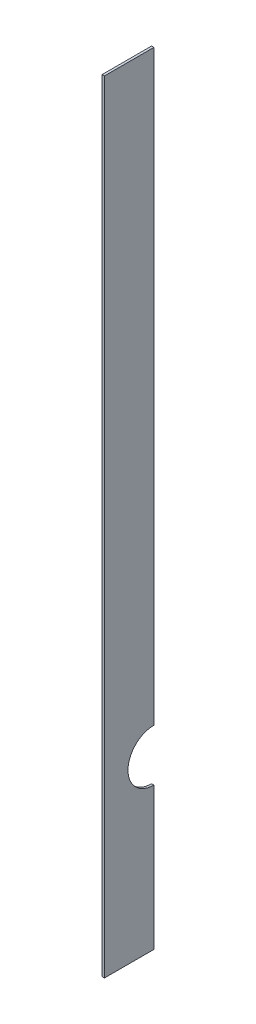
ISO-10303-21;
HEADER;
FILE_DESCRIPTION(('STEP AP214'),'2;1');
FILE_NAME('part.step','',(''),(''),'','','');
FILE_SCHEMA(('AUTOMOTIVE_DESIGN { 1 0 10303 214 1 1 1 1 }'));
ENDSEC;
DATA;
#1=APPLICATION_CONTEXT('core data for automotive mechanical design processes');
#2=APPLICATION_PROTOCOL_DEFINITION('international standard','automotive_design',2000,#1);
#3=PRODUCT_CONTEXT('',#1,'mechanical');
#4=PRODUCT('Part','Part','',(#3));
#5=PRODUCT_RELATED_PRODUCT_CATEGORY('part','',(#4));
#6=PRODUCT_DEFINITION_FORMATION('','',#4);
#7=PRODUCT_DEFINITION_CONTEXT('part definition',#1,'design');
#8=PRODUCT_DEFINITION('design','',#6,#7);
#9=PRODUCT_DEFINITION_SHAPE('','',#8);
#10=(LENGTH_UNIT() NAMED_UNIT(*) SI_UNIT(.MILLI.,.METRE.));
#11=(NAMED_UNIT(*) PLANE_ANGLE_UNIT() SI_UNIT($,.RADIAN.));
#12=(NAMED_UNIT(*) SI_UNIT($,.STERADIAN.) SOLID_ANGLE_UNIT());
#13=UNCERTAINTY_MEASURE_WITH_UNIT(LENGTH_MEASURE(1.E-05),#10,'distance_accuracy_value','');
#14=(GEOMETRIC_REPRESENTATION_CONTEXT(3) GLOBAL_UNCERTAINTY_ASSIGNED_CONTEXT((#13)) GLOBAL_UNIT_ASSIGNED_CONTEXT((#10,
#11,#12)) REPRESENTATION_CONTEXT('',''));
#15=CARTESIAN_POINT('',(0.,0.,0.));
#16=DIRECTION('',(0.,0.,1.));
#17=DIRECTION('',(1.,0.,0.));
#18=AXIS2_PLACEMENT_3D('',#15,#16,#17);
#19=CARTESIAN_POINT('',(-907.999999999999,-728.,-906.));
#20=DIRECTION('',(0.,0.,-1.));
#21=DIRECTION('',(-1.,0.,0.));
#22=AXIS2_PLACEMENT_3D('',#19,#20,#21);
#23=PLANE('',#22);
#24=DIRECTION('',(1.,0.,0.));
#25=VECTOR('',#24,1.);
#26=CARTESIAN_POINT('',(-1050.,-557.999999999999,-906.));
#27=LINE('',#26,#25);
#28=CARTESIAN_POINT('',(528.,-557.999999999999,-906.));
#29=VERTEX_POINT('',#28);
#30=CARTESIAN_POINT('',(530.,-557.999999999999,-906.));
#31=VERTEX_POINT('',#30);
#32=EDGE_CURVE('E48',#29,#31,#27,.T.);
#33=ORIENTED_EDGE('',*,*,#32,.F.);
#34=DIRECTION('',(0.,-1.,0.));
#35=VECTOR('',#34,1.);
#36=CARTESIAN_POINT('',(528.,-58.9999999999999,-906.));
#37=LINE('',#36,#35);
#38=CARTESIAN_POINT('',(528.,-58.9999999999999,-906.));
#39=VERTEX_POINT('',#38);
#40=EDGE_CURVE('E114',#39,#29,#37,.T.);
#41=ORIENTED_EDGE('',*,*,#40,.F.);
#42=DIRECTION('',(-1.,0.,0.));
#43=VECTOR('',#42,1.);
#44=CARTESIAN_POINT('',(530.,-58.9999999999999,-906.));
#45=LINE('',#44,#43);
#46=CARTESIAN_POINT('',(530.,-58.9999999999999,-906.));
#47=VERTEX_POINT('',#46);
#48=EDGE_CURVE('E81',#47,#39,#45,.T.);
#49=ORIENTED_EDGE('',*,*,#48,.F.);
#50=DIRECTION('',(0.,-1.,0.));
#51=VECTOR('',#50,1.);
#52=CARTESIAN_POINT('',(530.,-58.9999999999999,-906.));
#53=LINE('',#52,#51);
#54=EDGE_CURVE('E105',#47,#31,#53,.T.);
#55=ORIENTED_EDGE('',*,*,#54,.T.);
#56=EDGE_LOOP('',(#33,#41,#49,#55));
#57=FACE_BOUND('',#56,.T.);
#58=ADVANCED_FACE('F32',(#57),#23,.T.);
#59=DIRECTION('',(1.,0.,0.));
#60=VECTOR('',#59,1.);
#61=CARTESIAN_POINT('',(-1050.,-601.999999999999,-906.));
#62=LINE('',#61,#60);
#63=CARTESIAN_POINT('',(530.,-601.999999999999,-906.));
#64=VERTEX_POINT('',#63);
#65=CARTESIAN_POINT('',(528.,-601.999999999999,-906.));
#66=VERTEX_POINT('',#65);
#67=EDGE_CURVE('E92',#64,#66,#62,.F.);
#68=ORIENTED_EDGE('',*,*,#67,.F.);
#69=CARTESIAN_POINT('',(530.,-723.,-906.));
#70=VERTEX_POINT('',#69);
#71=EDGE_CURVE('E98',#64,#70,#53,.T.);
#72=ORIENTED_EDGE('',*,*,#71,.T.);
#73=DIRECTION('',(1.,0.,0.));
#74=VECTOR('',#73,1.);
#75=CARTESIAN_POINT('',(528.,-723.,-906.));
#76=LINE('',#75,#74);
#77=CARTESIAN_POINT('',(528.,-723.,-906.));
#78=VERTEX_POINT('',#77);
#79=EDGE_CURVE('E111',#78,#70,#76,.T.);
#80=ORIENTED_EDGE('',*,*,#79,.F.);
#81=EDGE_CURVE('E100',#66,#78,#37,.T.);
#82=ORIENTED_EDGE('',*,*,#81,.F.);
#83=EDGE_LOOP('',(#68,#72,#80,#82));
#84=FACE_BOUND('',#83,.T.);
#85=ADVANCED_FACE('F34',(#84),#23,.T.);
#86=CARTESIAN_POINT('',(0.,0.,-864.));
#87=DIRECTION('',(0.,0.,1.));
#88=DIRECTION('',(1.,0.,0.));
#89=AXIS2_PLACEMENT_3D('',#86,#87,#88);
#90=PLANE('',#89);
#91=DIRECTION('',(0.,-1.,0.));
#92=VECTOR('',#91,1.);
#93=CARTESIAN_POINT('',(530.,-58.9999999999999,-864.));
#94=LINE('',#93,#92);
#95=CARTESIAN_POINT('',(530.,-58.9999999999999,-864.));
#96=VERTEX_POINT('',#95);
#97=CARTESIAN_POINT('',(530.,-723.,-864.));
#98=VERTEX_POINT('',#97);
#99=EDGE_CURVE('E11',#96,#98,#94,.T.);
#100=ORIENTED_EDGE('',*,*,#99,.F.);
#101=DIRECTION('',(-1.,0.,0.));
#102=VECTOR('',#101,1.);
#103=CARTESIAN_POINT('',(530.,-58.9999999999999,-864.));
#104=LINE('',#103,#102);
#105=CARTESIAN_POINT('',(528.,-58.9999999999999,-864.));
#106=VERTEX_POINT('',#105);
#107=EDGE_CURVE('E107',#96,#106,#104,.T.);
#108=ORIENTED_EDGE('',*,*,#107,.T.);
#109=DIRECTION('',(0.,1.,0.));
#110=VECTOR('',#109,1.);
#111=CARTESIAN_POINT('',(528.,-58.9999999999999,-864.));
#112=LINE('',#111,#110);
#113=CARTESIAN_POINT('',(528.,-723.,-864.));
#114=VERTEX_POINT('',#113);
#115=EDGE_CURVE('E125',#106,#114,#112,.F.);
#116=ORIENTED_EDGE('',*,*,#115,.T.);
#117=DIRECTION('',(1.,0.,0.));
#118=VECTOR('',#117,1.);
#119=CARTESIAN_POINT('',(528.,-723.,-864.));
#120=LINE('',#119,#118);
#121=EDGE_CURVE('E123',#114,#98,#120,.T.);
#122=ORIENTED_EDGE('',*,*,#121,.T.);
#123=EDGE_LOOP('',(#100,#108,#116,#122));
#124=FACE_BOUND('',#123,.T.);
#125=ADVANCED_FACE('F134',(#124),#90,.T.);
#126=CARTESIAN_POINT('',(530.,-58.9999999999999,-1570.00301204136));
#127=DIRECTION('',(0.,1.,0.));
#128=DIRECTION('',(0.,0.,1.));
#129=AXIS2_PLACEMENT_3D('',#126,#127,#128);
#130=PLANE('',#129);
#131=DIRECTION('',(0.,0.,1.));
#132=VECTOR('',#131,1.);
#133=CARTESIAN_POINT('',(530.,-58.9999999999999,-1570.00301204136));
#134=LINE('',#133,#132);
#135=EDGE_CURVE('E36',#47,#96,#134,.T.);
#136=ORIENTED_EDGE('',*,*,#135,.F.);
#137=ORIENTED_EDGE('',*,*,#48,.T.);
#138=DIRECTION('',(0.,0.,1.));
#139=VECTOR('',#138,1.);
#140=CARTESIAN_POINT('',(528.,-58.9999999999999,-1570.00301204136));
#141=LINE('',#140,#139);
#142=EDGE_CURVE('E118',#39,#106,#141,.T.);
#143=ORIENTED_EDGE('',*,*,#142,.T.);
#144=ORIENTED_EDGE('',*,*,#107,.F.);
#145=EDGE_LOOP('',(#136,#137,#143,#144));
#146=FACE_BOUND('',#145,.T.);
#147=ADVANCED_FACE('F135',(#146),#130,.T.);
#148=CARTESIAN_POINT('',(528.,-58.9999999999999,-1570.00301204136));
#149=DIRECTION('',(-1.,0.,0.));
#150=DIRECTION('',(0.,0.,1.));
#151=AXIS2_PLACEMENT_3D('',#148,#149,#150);
#152=PLANE('',#151);
#153=CARTESIAN_POINT('',(528.,-579.999999999999,-906.));
#154=DIRECTION('',(-1.,0.,0.));
#155=DIRECTION('',(0.,0.,1.));
#156=AXIS2_PLACEMENT_3D('',#153,#154,#155);
#157=CIRCLE('',#156,22.0000000000001);
#158=EDGE_CURVE('E85',#66,#29,#157,.T.);
#159=ORIENTED_EDGE('',*,*,#158,.F.);
#160=ORIENTED_EDGE('',*,*,#81,.T.);
#161=DIRECTION('',(0.,0.,1.));
#162=VECTOR('',#161,1.);
#163=CARTESIAN_POINT('',(528.,-723.,-1570.00301204136));
#164=LINE('',#163,#162);
#165=EDGE_CURVE('E113',#78,#114,#164,.T.);
#166=ORIENTED_EDGE('',*,*,#165,.T.);
#167=ORIENTED_EDGE('',*,*,#115,.F.);
#168=ORIENTED_EDGE('',*,*,#142,.F.);
#169=ORIENTED_EDGE('',*,*,#40,.T.);
#170=EDGE_LOOP('',(#159,#160,#166,#167,#168,#169));
#171=FACE_BOUND('',#170,.T.);
#172=ADVANCED_FACE('F137',(#171),#152,.T.);
#173=CARTESIAN_POINT('',(528.,-723.,-1570.00301204136));
#174=DIRECTION('',(0.,-1.,0.));
#175=DIRECTION('',(0.,0.,-1.));
#176=AXIS2_PLACEMENT_3D('',#173,#174,#175);
#177=PLANE('',#176);
#178=ORIENTED_EDGE('',*,*,#165,.F.);
#179=ORIENTED_EDGE('',*,*,#79,.T.);
#180=DIRECTION('',(0.,0.,1.));
#181=VECTOR('',#180,1.);
#182=CARTESIAN_POINT('',(530.,-723.,-1570.00301204136));
#183=LINE('',#182,#181);
#184=EDGE_CURVE('E103',#70,#98,#183,.T.);
#185=ORIENTED_EDGE('',*,*,#184,.T.);
#186=ORIENTED_EDGE('',*,*,#121,.F.);
#187=EDGE_LOOP('',(#178,#179,#185,#186));
#188=FACE_BOUND('',#187,.T.);
#189=ADVANCED_FACE('F142',(#188),#177,.T.);
#190=CARTESIAN_POINT('',(530.,-58.9999999999999,-1570.00301204136));
#191=DIRECTION('',(-1.,0.,0.));
#192=DIRECTION('',(0.,0.,1.));
#193=AXIS2_PLACEMENT_3D('',#190,#191,#192);
#194=PLANE('',#193);
#195=ORIENTED_EDGE('',*,*,#71,.F.);
#196=CARTESIAN_POINT('',(530.,-579.999999999999,-906.));
#197=DIRECTION('',(1.,0.,0.));
#198=DIRECTION('',(0.,0.,-1.));
#199=AXIS2_PLACEMENT_3D('',#196,#197,#198);
#200=CIRCLE('',#199,22.0000000000001);
#201=EDGE_CURVE('E89',#31,#64,#200,.T.);
#202=ORIENTED_EDGE('',*,*,#201,.F.);
#203=ORIENTED_EDGE('',*,*,#54,.F.);
#204=ORIENTED_EDGE('',*,*,#135,.T.);
#205=ORIENTED_EDGE('',*,*,#99,.T.);
#206=ORIENTED_EDGE('',*,*,#184,.F.);
#207=EDGE_LOOP('',(#195,#202,#203,#204,#205,#206));
#208=FACE_BOUND('',#207,.T.);
#209=ADVANCED_FACE('F102',(#208),#194,.F.);
#210=CARTESIAN_POINT('',(-1050.,-579.999999999999,-906.));
#211=DIRECTION('',(1.,0.,0.));
#212=DIRECTION('',(0.,0.,-1.));
#213=AXIS2_PLACEMENT_3D('',#210,#211,#212);
#214=CYLINDRICAL_SURFACE('',#213,22.0000000000001);
#215=ORIENTED_EDGE('',*,*,#32,.T.);
#216=ORIENTED_EDGE('',*,*,#201,.T.);
#217=ORIENTED_EDGE('',*,*,#67,.T.);
#218=ORIENTED_EDGE('',*,*,#158,.T.);
#219=EDGE_LOOP('',(#215,#216,#217,#218));
#220=FACE_BOUND('',#219,.T.);
#221=ADVANCED_FACE('F91',(#220),#214,.F.);
#222=CLOSED_SHELL('',(#58,#85,#125,#147,#172,#189,#209,#221));
#223=MANIFOLD_SOLID_BREP('B2',#222);
#224=ADVANCED_BREP_SHAPE_REPRESENTATION('',(#18,#223),#14);
#225=SHAPE_DEFINITION_REPRESENTATION(#9,#224);
ENDSEC;
END-ISO-10303-21;
